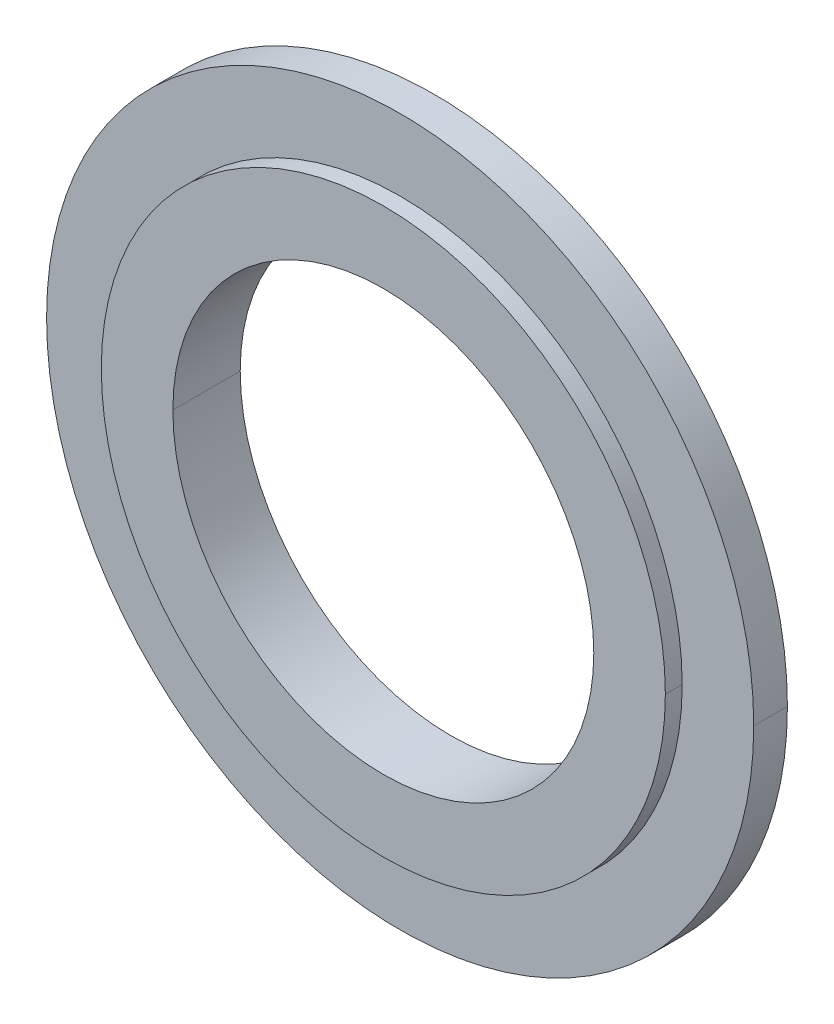
ISO-10303-21;
HEADER;
FILE_DESCRIPTION(('STEP AP214'),'2;1');
FILE_NAME('part.step','',(''),(''),'','','');
FILE_SCHEMA(('AUTOMOTIVE_DESIGN { 1 0 10303 214 1 1 1 1 }'));
ENDSEC;
DATA;
#1=APPLICATION_CONTEXT('core data for automotive mechanical design processes');
#2=APPLICATION_PROTOCOL_DEFINITION('international standard','automotive_design',2000,#1);
#3=PRODUCT_CONTEXT('',#1,'mechanical');
#4=PRODUCT('Part','Part','',(#3));
#5=PRODUCT_RELATED_PRODUCT_CATEGORY('part','',(#4));
#6=PRODUCT_DEFINITION_FORMATION('','',#4);
#7=PRODUCT_DEFINITION_CONTEXT('part definition',#1,'design');
#8=PRODUCT_DEFINITION('design','',#6,#7);
#9=PRODUCT_DEFINITION_SHAPE('','',#8);
#10=(LENGTH_UNIT() NAMED_UNIT(*) SI_UNIT(.MILLI.,.METRE.));
#11=(NAMED_UNIT(*) PLANE_ANGLE_UNIT() SI_UNIT($,.RADIAN.));
#12=(NAMED_UNIT(*) SI_UNIT($,.STERADIAN.) SOLID_ANGLE_UNIT());
#13=UNCERTAINTY_MEASURE_WITH_UNIT(LENGTH_MEASURE(1.E-05),#10,'distance_accuracy_value','');
#14=(GEOMETRIC_REPRESENTATION_CONTEXT(3) GLOBAL_UNCERTAINTY_ASSIGNED_CONTEXT((#13)) GLOBAL_UNIT_ASSIGNED_CONTEXT((#10,
#11,#12)) REPRESENTATION_CONTEXT('',''));
#15=CARTESIAN_POINT('',(0.,0.,0.));
#16=DIRECTION('',(0.,0.,1.));
#17=DIRECTION('',(1.,0.,0.));
#18=AXIS2_PLACEMENT_3D('',#15,#16,#17);
#19=CARTESIAN_POINT('',(0.,8.375,2.));
#20=DIRECTION('',(0.,0.,1.));
#21=DIRECTION('',(1.,0.,0.));
#22=AXIS2_PLACEMENT_3D('',#19,#20,#21);
#23=PLANE('',#22);
#24=CARTESIAN_POINT('',(0.,0.,2.));
#25=DIRECTION('',(0.,0.,-1.));
#26=DIRECTION('',(-1.,0.,0.));
#27=AXIS2_PLACEMENT_3D('',#24,#25,#26);
#28=CIRCLE('',#27,6.25);
#29=CARTESIAN_POINT('',(-6.25,0.,2.));
#30=VERTEX_POINT('',#29);
#31=CARTESIAN_POINT('',(6.25,0.,2.));
#32=VERTEX_POINT('',#31);
#33=EDGE_CURVE('E11',#30,#32,#28,.T.);
#34=ORIENTED_EDGE('',*,*,#33,.T.);
#35=CARTESIAN_POINT('',(0.,0.,2.));
#36=DIRECTION('',(0.,0.,-1.));
#37=DIRECTION('',(-1.,0.,0.));
#38=AXIS2_PLACEMENT_3D('',#35,#36,#37);
#39=CIRCLE('',#38,6.25);
#40=EDGE_CURVE('E25',#32,#30,#39,.T.);
#41=ORIENTED_EDGE('',*,*,#40,.T.);
#42=EDGE_LOOP('',(#34,#41));
#43=FACE_BOUND('',#42,.T.);
#44=CARTESIAN_POINT('',(0.,0.,2.));
#45=DIRECTION('',(0.,0.,-1.));
#46=DIRECTION('',(-1.,0.,0.));
#47=AXIS2_PLACEMENT_3D('',#44,#45,#46);
#48=CIRCLE('',#47,8.375);
#49=CARTESIAN_POINT('',(8.375,0.,2.));
#50=VERTEX_POINT('',#49);
#51=CARTESIAN_POINT('',(-8.375,0.,2.));
#52=VERTEX_POINT('',#51);
#53=EDGE_CURVE('E177',#50,#52,#48,.T.);
#54=ORIENTED_EDGE('',*,*,#53,.F.);
#55=CARTESIAN_POINT('',(0.,0.,2.));
#56=DIRECTION('',(0.,0.,-1.));
#57=DIRECTION('',(-1.,0.,0.));
#58=AXIS2_PLACEMENT_3D('',#55,#56,#57);
#59=CIRCLE('',#58,8.375);
#60=EDGE_CURVE('E172',#52,#50,#59,.T.);
#61=ORIENTED_EDGE('',*,*,#60,.F.);
#62=EDGE_LOOP('',(#54,#61));
#63=FACE_BOUND('',#62,.T.);
#64=ADVANCED_FACE('F17',(#43,#63),#23,.T.);
#65=CARTESIAN_POINT('',(0.,0.,0.));
#66=DIRECTION('',(0.,0.,-1.));
#67=DIRECTION('',(0.,-1.,0.));
#68=AXIS2_PLACEMENT_3D('',#65,#66,#67);
#69=CYLINDRICAL_SURFACE('',#68,8.375);
#70=DIRECTION('',(0.,0.,-1.));
#71=VECTOR('',#70,1.);
#72=CARTESIAN_POINT('',(8.375,0.,2.));
#73=LINE('',#72,#71);
#74=CARTESIAN_POINT('',(8.375,0.,1.5));
#75=VERTEX_POINT('',#74);
#76=EDGE_CURVE('E168',#50,#75,#73,.T.);
#77=ORIENTED_EDGE('',*,*,#76,.T.);
#78=CARTESIAN_POINT('',(0.,0.,1.5));
#79=DIRECTION('',(0.,0.,-1.));
#80=DIRECTION('',(-1.,0.,0.));
#81=AXIS2_PLACEMENT_3D('',#78,#79,#80);
#82=CIRCLE('',#81,8.375);
#83=CARTESIAN_POINT('',(-8.375,0.,1.5));
#84=VERTEX_POINT('',#83);
#85=EDGE_CURVE('E163',#84,#75,#82,.T.);
#86=ORIENTED_EDGE('',*,*,#85,.F.);
#87=DIRECTION('',(0.,0.,-1.));
#88=VECTOR('',#87,1.);
#89=CARTESIAN_POINT('',(-8.375,0.,2.));
#90=LINE('',#89,#88);
#91=EDGE_CURVE('E158',#52,#84,#90,.T.);
#92=ORIENTED_EDGE('',*,*,#91,.F.);
#93=ORIENTED_EDGE('',*,*,#60,.T.);
#94=EDGE_LOOP('',(#77,#86,#92,#93));
#95=FACE_BOUND('',#94,.T.);
#96=ADVANCED_FACE('F193',(#95),#69,.T.);
#97=CARTESIAN_POINT('',(0.,0.,0.));
#98=DIRECTION('',(0.,0.,-1.));
#99=DIRECTION('',(0.,1.,0.));
#100=AXIS2_PLACEMENT_3D('',#97,#98,#99);
#101=CYLINDRICAL_SURFACE('',#100,8.375);
#102=ORIENTED_EDGE('',*,*,#76,.F.);
#103=ORIENTED_EDGE('',*,*,#53,.T.);
#104=ORIENTED_EDGE('',*,*,#91,.T.);
#105=CARTESIAN_POINT('',(0.,0.,1.5));
#106=DIRECTION('',(0.,0.,-1.));
#107=DIRECTION('',(-1.,0.,0.));
#108=AXIS2_PLACEMENT_3D('',#105,#106,#107);
#109=CIRCLE('',#108,8.375);
#110=EDGE_CURVE('E153',#75,#84,#109,.T.);
#111=ORIENTED_EDGE('',*,*,#110,.F.);
#112=EDGE_LOOP('',(#102,#103,#104,#111));
#113=FACE_BOUND('',#112,.T.);
#114=ADVANCED_FACE('F188',(#113),#101,.T.);
#115=CARTESIAN_POINT('',(0.,10.5,1.5));
#116=DIRECTION('',(0.,0.,1.));
#117=DIRECTION('',(1.,0.,0.));
#118=AXIS2_PLACEMENT_3D('',#115,#116,#117);
#119=PLANE('',#118);
#120=ORIENTED_EDGE('',*,*,#85,.T.);
#121=ORIENTED_EDGE('',*,*,#110,.T.);
#122=EDGE_LOOP('',(#120,#121));
#123=FACE_BOUND('',#122,.T.);
#124=CARTESIAN_POINT('',(0.,0.,1.5));
#125=DIRECTION('',(0.,0.,-1.));
#126=DIRECTION('',(-1.,0.,0.));
#127=AXIS2_PLACEMENT_3D('',#124,#125,#126);
#128=CIRCLE('',#127,10.5);
#129=CARTESIAN_POINT('',(10.5,0.,1.5));
#130=VERTEX_POINT('',#129);
#131=CARTESIAN_POINT('',(-10.5,0.,1.5));
#132=VERTEX_POINT('',#131);
#133=EDGE_CURVE('E148',#130,#132,#128,.T.);
#134=ORIENTED_EDGE('',*,*,#133,.F.);
#135=CARTESIAN_POINT('',(0.,0.,1.5));
#136=DIRECTION('',(0.,0.,-1.));
#137=DIRECTION('',(-1.,0.,0.));
#138=AXIS2_PLACEMENT_3D('',#135,#136,#137);
#139=CIRCLE('',#138,10.5);
#140=EDGE_CURVE('E143',#132,#130,#139,.T.);
#141=ORIENTED_EDGE('',*,*,#140,.F.);
#142=EDGE_LOOP('',(#134,#141));
#143=FACE_BOUND('',#142,.T.);
#144=ADVANCED_FACE('F195',(#123,#143),#119,.T.);
#145=CARTESIAN_POINT('',(0.,0.,0.));
#146=DIRECTION('',(0.,0.,-1.));
#147=DIRECTION('',(0.,-1.,0.));
#148=AXIS2_PLACEMENT_3D('',#145,#146,#147);
#149=CYLINDRICAL_SURFACE('',#148,10.5);
#150=DIRECTION('',(0.,0.,-1.));
#151=VECTOR('',#150,1.);
#152=CARTESIAN_POINT('',(10.5,0.,1.5));
#153=LINE('',#152,#151);
#154=CARTESIAN_POINT('',(10.5,0.,0.5));
#155=VERTEX_POINT('',#154);
#156=EDGE_CURVE('E139',#130,#155,#153,.T.);
#157=ORIENTED_EDGE('',*,*,#156,.T.);
#158=CARTESIAN_POINT('',(0.,0.,0.5));
#159=DIRECTION('',(0.,0.,-1.));
#160=DIRECTION('',(-1.,0.,0.));
#161=AXIS2_PLACEMENT_3D('',#158,#159,#160);
#162=CIRCLE('',#161,10.5);
#163=CARTESIAN_POINT('',(-10.5,0.,0.5));
#164=VERTEX_POINT('',#163);
#165=EDGE_CURVE('E134',#164,#155,#162,.T.);
#166=ORIENTED_EDGE('',*,*,#165,.F.);
#167=DIRECTION('',(0.,0.,-1.));
#168=VECTOR('',#167,1.);
#169=CARTESIAN_POINT('',(-10.5,0.,1.5));
#170=LINE('',#169,#168);
#171=EDGE_CURVE('E129',#132,#164,#170,.T.);
#172=ORIENTED_EDGE('',*,*,#171,.F.);
#173=ORIENTED_EDGE('',*,*,#140,.T.);
#174=EDGE_LOOP('',(#157,#166,#172,#173));
#175=FACE_BOUND('',#174,.T.);
#176=ADVANCED_FACE('F198',(#175),#149,.T.);
#177=CARTESIAN_POINT('',(0.,0.,0.));
#178=DIRECTION('',(0.,0.,-1.));
#179=DIRECTION('',(0.,1.,0.));
#180=AXIS2_PLACEMENT_3D('',#177,#178,#179);
#181=CYLINDRICAL_SURFACE('',#180,10.5);
#182=ORIENTED_EDGE('',*,*,#156,.F.);
#183=ORIENTED_EDGE('',*,*,#133,.T.);
#184=ORIENTED_EDGE('',*,*,#171,.T.);
#185=CARTESIAN_POINT('',(0.,0.,0.5));
#186=DIRECTION('',(0.,0.,-1.));
#187=DIRECTION('',(-1.,0.,0.));
#188=AXIS2_PLACEMENT_3D('',#185,#186,#187);
#189=CIRCLE('',#188,10.5);
#190=EDGE_CURVE('E124',#155,#164,#189,.T.);
#191=ORIENTED_EDGE('',*,*,#190,.F.);
#192=EDGE_LOOP('',(#182,#183,#184,#191));
#193=FACE_BOUND('',#192,.T.);
#194=ADVANCED_FACE('F204',(#193),#181,.T.);
#195=CARTESIAN_POINT('',(0.,8.375,0.5));
#196=DIRECTION('',(0.,0.,-1.));
#197=DIRECTION('',(-1.,0.,0.));
#198=AXIS2_PLACEMENT_3D('',#195,#196,#197);
#199=PLANE('',#198);
#200=ORIENTED_EDGE('',*,*,#165,.T.);
#201=ORIENTED_EDGE('',*,*,#190,.T.);
#202=EDGE_LOOP('',(#200,#201));
#203=FACE_BOUND('',#202,.T.);
#204=CARTESIAN_POINT('',(0.,0.,0.5));
#205=DIRECTION('',(0.,0.,-1.));
#206=DIRECTION('',(-1.,0.,0.));
#207=AXIS2_PLACEMENT_3D('',#204,#205,#206);
#208=CIRCLE('',#207,8.375);
#209=CARTESIAN_POINT('',(8.375,0.,0.5));
#210=VERTEX_POINT('',#209);
#211=CARTESIAN_POINT('',(-8.375,0.,0.5));
#212=VERTEX_POINT('',#211);
#213=EDGE_CURVE('E119',#210,#212,#208,.T.);
#214=ORIENTED_EDGE('',*,*,#213,.F.);
#215=CARTESIAN_POINT('',(0.,0.,0.5));
#216=DIRECTION('',(0.,0.,-1.));
#217=DIRECTION('',(-1.,0.,0.));
#218=AXIS2_PLACEMENT_3D('',#215,#216,#217);
#219=CIRCLE('',#218,8.375);
#220=EDGE_CURVE('E114',#212,#210,#219,.T.);
#221=ORIENTED_EDGE('',*,*,#220,.F.);
#222=EDGE_LOOP('',(#214,#221));
#223=FACE_BOUND('',#222,.T.);
#224=ADVANCED_FACE('F207',(#203,#223),#199,.T.);
#225=CARTESIAN_POINT('',(0.,0.,0.));
#226=DIRECTION('',(0.,0.,-1.));
#227=DIRECTION('',(0.,-1.,0.));
#228=AXIS2_PLACEMENT_3D('',#225,#226,#227);
#229=CYLINDRICAL_SURFACE('',#228,8.375);
#230=DIRECTION('',(0.,0.,-1.));
#231=VECTOR('',#230,1.);
#232=CARTESIAN_POINT('',(8.375,0.,0.5));
#233=LINE('',#232,#231);
#234=CARTESIAN_POINT('',(8.375,0.,0.));
#235=VERTEX_POINT('',#234);
#236=EDGE_CURVE('E110',#210,#235,#233,.T.);
#237=ORIENTED_EDGE('',*,*,#236,.T.);
#238=CARTESIAN_POINT('',(0.,0.,0.));
#239=DIRECTION('',(0.,0.,-1.));
#240=DIRECTION('',(-1.,0.,0.));
#241=AXIS2_PLACEMENT_3D('',#238,#239,#240);
#242=CIRCLE('',#241,8.375);
#243=CARTESIAN_POINT('',(-8.375,0.,0.));
#244=VERTEX_POINT('',#243);
#245=EDGE_CURVE('E105',#244,#235,#242,.T.);
#246=ORIENTED_EDGE('',*,*,#245,.F.);
#247=DIRECTION('',(0.,0.,-1.));
#248=VECTOR('',#247,1.);
#249=CARTESIAN_POINT('',(-8.375,0.,0.5));
#250=LINE('',#249,#248);
#251=EDGE_CURVE('E94',#212,#244,#250,.T.);
#252=ORIENTED_EDGE('',*,*,#251,.F.);
#253=ORIENTED_EDGE('',*,*,#220,.T.);
#254=EDGE_LOOP('',(#237,#246,#252,#253));
#255=FACE_BOUND('',#254,.T.);
#256=ADVANCED_FACE('F210',(#255),#229,.T.);
#257=CARTESIAN_POINT('',(0.,0.,0.));
#258=DIRECTION('',(0.,0.,-1.));
#259=DIRECTION('',(0.,1.,0.));
#260=AXIS2_PLACEMENT_3D('',#257,#258,#259);
#261=CYLINDRICAL_SURFACE('',#260,8.375);
#262=ORIENTED_EDGE('',*,*,#236,.F.);
#263=ORIENTED_EDGE('',*,*,#213,.T.);
#264=ORIENTED_EDGE('',*,*,#251,.T.);
#265=CARTESIAN_POINT('',(0.,0.,0.));
#266=DIRECTION('',(0.,0.,-1.));
#267=DIRECTION('',(-1.,0.,0.));
#268=AXIS2_PLACEMENT_3D('',#265,#266,#267);
#269=CIRCLE('',#268,8.375);
#270=EDGE_CURVE('E91',#235,#244,#269,.T.);
#271=ORIENTED_EDGE('',*,*,#270,.F.);
#272=EDGE_LOOP('',(#262,#263,#264,#271));
#273=FACE_BOUND('',#272,.T.);
#274=ADVANCED_FACE('F216',(#273),#261,.T.);
#275=CARTESIAN_POINT('',(0.,6.25,0.));
#276=DIRECTION('',(0.,0.,-1.));
#277=DIRECTION('',(-1.,0.,0.));
#278=AXIS2_PLACEMENT_3D('',#275,#276,#277);
#279=PLANE('',#278);
#280=ORIENTED_EDGE('',*,*,#245,.T.);
#281=ORIENTED_EDGE('',*,*,#270,.T.);
#282=EDGE_LOOP('',(#280,#281));
#283=FACE_BOUND('',#282,.T.);
#284=CARTESIAN_POINT('',(0.,0.,0.));
#285=DIRECTION('',(0.,0.,-1.));
#286=DIRECTION('',(-1.,0.,0.));
#287=AXIS2_PLACEMENT_3D('',#284,#285,#286);
#288=CIRCLE('',#287,6.25);
#289=CARTESIAN_POINT('',(6.25,0.,0.));
#290=VERTEX_POINT('',#289);
#291=CARTESIAN_POINT('',(-6.25,0.,0.));
#292=VERTEX_POINT('',#291);
#293=EDGE_CURVE('E79',#290,#292,#288,.T.);
#294=ORIENTED_EDGE('',*,*,#293,.F.);
#295=CARTESIAN_POINT('',(0.,0.,0.));
#296=DIRECTION('',(0.,0.,-1.));
#297=DIRECTION('',(-1.,0.,0.));
#298=AXIS2_PLACEMENT_3D('',#295,#296,#297);
#299=CIRCLE('',#298,6.25);
#300=EDGE_CURVE('E75',#292,#290,#299,.T.);
#301=ORIENTED_EDGE('',*,*,#300,.F.);
#302=EDGE_LOOP('',(#294,#301));
#303=FACE_BOUND('',#302,.T.);
#304=ADVANCED_FACE('F77',(#283,#303),#279,.T.);
#305=CARTESIAN_POINT('',(0.,0.,0.));
#306=DIRECTION('',(0.,0.,-1.));
#307=DIRECTION('',(0.,-1.,0.));
#308=AXIS2_PLACEMENT_3D('',#305,#306,#307);
#309=CYLINDRICAL_SURFACE('',#308,6.25);
#310=DIRECTION('',(0.,0.,-1.));
#311=VECTOR('',#310,1.);
#312=CARTESIAN_POINT('',(6.25,0.,2.));
#313=LINE('',#312,#311);
#314=EDGE_CURVE('E83',#32,#290,#313,.T.);
#315=ORIENTED_EDGE('',*,*,#314,.F.);
#316=ORIENTED_EDGE('',*,*,#33,.F.);
#317=DIRECTION('',(0.,0.,-1.));
#318=VECTOR('',#317,1.);
#319=CARTESIAN_POINT('',(-6.25,0.,2.));
#320=LINE('',#319,#318);
#321=EDGE_CURVE('E86',#30,#292,#320,.T.);
#322=ORIENTED_EDGE('',*,*,#321,.T.);
#323=ORIENTED_EDGE('',*,*,#300,.T.);
#324=EDGE_LOOP('',(#315,#316,#322,#323));
#325=FACE_BOUND('',#324,.T.);
#326=ADVANCED_FACE('F87',(#325),#309,.F.);
#327=CARTESIAN_POINT('',(0.,0.,0.));
#328=DIRECTION('',(0.,0.,-1.));
#329=DIRECTION('',(0.,1.,0.));
#330=AXIS2_PLACEMENT_3D('',#327,#328,#329);
#331=CYLINDRICAL_SURFACE('',#330,6.25);
#332=ORIENTED_EDGE('',*,*,#314,.T.);
#333=ORIENTED_EDGE('',*,*,#293,.T.);
#334=ORIENTED_EDGE('',*,*,#321,.F.);
#335=ORIENTED_EDGE('',*,*,#40,.F.);
#336=EDGE_LOOP('',(#332,#333,#334,#335));
#337=FACE_BOUND('',#336,.T.);
#338=ADVANCED_FACE('F90',(#337),#331,.F.);
#339=CLOSED_SHELL('',(#64,#96,#114,#144,#176,#194,#224,#256,#274,#304,#326,#338));
#340=MANIFOLD_SOLID_BREP('B1',#339);
#341=ADVANCED_BREP_SHAPE_REPRESENTATION('',(#18,#340),#14);
#342=SHAPE_DEFINITION_REPRESENTATION(#9,#341);
ENDSEC;
END-ISO-10303-21;
